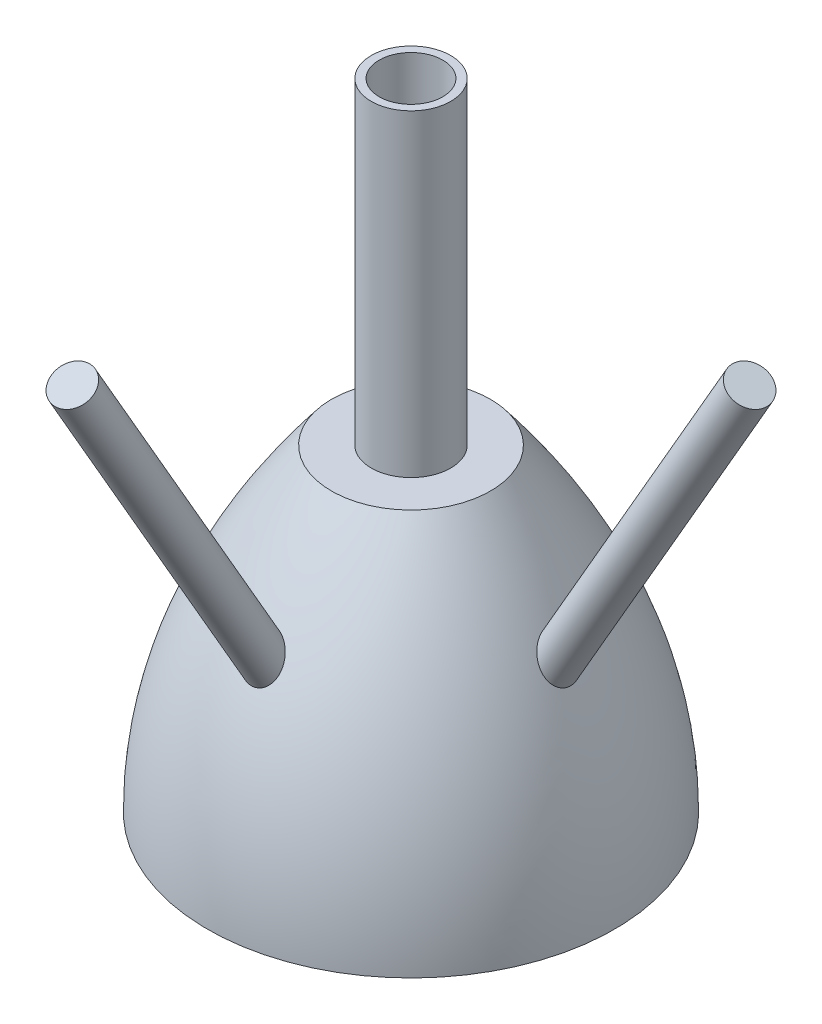
ISO-10303-21;
HEADER;
FILE_DESCRIPTION(('STEP AP214'),'2;1');
FILE_NAME('part.step','',(''),(''),'','','');
FILE_SCHEMA(('AUTOMOTIVE_DESIGN { 1 0 10303 214 1 1 1 1 }'));
ENDSEC;
DATA;
#1=APPLICATION_CONTEXT('core data for automotive mechanical design processes');
#2=APPLICATION_PROTOCOL_DEFINITION('international standard','automotive_design',2000,#1);
#3=PRODUCT_CONTEXT('',#1,'mechanical');
#4=PRODUCT('Part','Part','',(#3));
#5=PRODUCT_RELATED_PRODUCT_CATEGORY('part','',(#4));
#6=PRODUCT_DEFINITION_FORMATION('','',#4);
#7=PRODUCT_DEFINITION_CONTEXT('part definition',#1,'design');
#8=PRODUCT_DEFINITION('design','',#6,#7);
#9=PRODUCT_DEFINITION_SHAPE('','',#8);
#10=(LENGTH_UNIT() NAMED_UNIT(*) SI_UNIT(.MILLI.,.METRE.));
#11=(NAMED_UNIT(*) PLANE_ANGLE_UNIT() SI_UNIT($,.RADIAN.));
#12=(NAMED_UNIT(*) SI_UNIT($,.STERADIAN.) SOLID_ANGLE_UNIT());
#13=UNCERTAINTY_MEASURE_WITH_UNIT(LENGTH_MEASURE(1.E-05),#10,'distance_accuracy_value','');
#14=(GEOMETRIC_REPRESENTATION_CONTEXT(3) GLOBAL_UNCERTAINTY_ASSIGNED_CONTEXT((#13)) GLOBAL_UNIT_ASSIGNED_CONTEXT((#10,
#11,#12)) REPRESENTATION_CONTEXT('',''));
#15=CARTESIAN_POINT('',(0.,0.,0.));
#16=DIRECTION('',(0.,0.,1.));
#17=DIRECTION('',(1.,0.,0.));
#18=AXIS2_PLACEMENT_3D('',#15,#16,#17);
#19=CARTESIAN_POINT('',(253.999999999969,1014.69207151779,0.));
#20=DIRECTION('',(0.,-1.,0.));
#21=DIRECTION('',(1.,0.,0.));
#22=AXIS2_PLACEMENT_3D('',#19,#20,#21);
#23=PLANE('',#22);
#24=CARTESIAN_POINT('',(-3.06421554796649E-11,1014.69207151778,0.));
#25=DIRECTION('',(0.,1.,0.));
#26=DIRECTION('',(-1.,0.,0.));
#27=AXIS2_PLACEMENT_3D('',#24,#25,#26);
#28=CIRCLE('',#27,126.999999999444);
#29=CARTESIAN_POINT('',(-126.999999999475,1014.69207151777,0.));
#30=VERTEX_POINT('',#29);
#31=EDGE_CURVE('E59',#30,#30,#28,.T.);
#32=ORIENTED_EDGE('',*,*,#31,.F.);
#33=EDGE_LOOP('',(#32));
#34=FACE_BOUND('',#33,.T.);
#35=CARTESIAN_POINT('',(-3.06421554796755E-11,1014.69207151813,0.));
#36=DIRECTION('',(0.,1.,0.));
#37=DIRECTION('',(-1.,0.,0.));
#38=AXIS2_PLACEMENT_3D('',#35,#36,#37);
#39=CIRCLE('',#38,253.999999999444);
#40=CARTESIAN_POINT('',(-253.999999999475,1014.69207151812,0.));
#41=VERTEX_POINT('',#40);
#42=EDGE_CURVE('E63',#41,#41,#39,.T.);
#43=ORIENTED_EDGE('',*,*,#42,.T.);
#44=EDGE_LOOP('',(#43));
#45=FACE_BOUND('',#44,.T.);
#46=ADVANCED_FACE('F48',(#34,#45),#23,.F.);
#47=CARTESIAN_POINT('',(-999350.,-50990.1951359248,0.));
#48=CARTESIAN_POINT('',(1000650.,-3.02691205433803E-09,0.));
#49=CARTESIAN_POINT('',(-999349.999999999,50990.1951359309,0.));
#50=B_SPLINE_CURVE_WITH_KNOTS('',2,(#47,#48,#49),.UNSPECIFIED.,.F.,.F.,(3,3),(0.,1.),.UNSPECIFIED.);
#51=CARTESIAN_POINT('',(-3.06421554796543E-11,1014.69207151743,0.));
#52=DIRECTION('',(0.,1.,0.));
#53=AXIS1_PLACEMENT('',#51,#52);
#54=SURFACE_OF_REVOLUTION('',#50,#53);
#55=CARTESIAN_POINT('',(440.634399216976,737.801167006452,-7.75329829454941E-05));
#56=CARTESIAN_POINT('',(440.634400580243,737.801163879456,1.02726602211633));
#57=CARTESIAN_POINT('',(440.646867099696,737.772861056492,2.05470877192513));
#58=CARTESIAN_POINT('',(440.696670486729,737.659827745046,4.10654697177626));
#59=CARTESIAN_POINT('',(440.734024807575,737.575057657322,5.13093977620922));
#60=CARTESIAN_POINT('',(440.833381161142,737.349706543828,7.1725359579091));
#61=CARTESIAN_POINT('',(440.895387172602,737.20911650882,8.18973814763722));
#62=CARTESIAN_POINT('',(441.043824004993,736.872812138134,10.2156697613446));
#63=CARTESIAN_POINT('',(441.130312502447,736.676967636092,11.22437331528));
#64=CARTESIAN_POINT('',(441.32709461239,736.231805798519,13.227361579559));
#65=CARTESIAN_POINT('',(441.437384397011,735.982497061471,14.221648581051));
#66=CARTESIAN_POINT('',(441.681114088638,735.432191450847,16.192865159312));
#67=CARTESIAN_POINT('',(441.814552495549,735.131197926601,17.1697958562978));
#68=CARTESIAN_POINT('',(442.067077648672,734.562355556504,18.8579223453866));
#69=CARTESIAN_POINT('',(442.181202452466,734.305503166955,19.5735942525196));
#70=CARTESIAN_POINT('',(442.421572338323,733.765111110867,20.9927403541006));
#71=CARTESIAN_POINT('',(442.547818197014,733.481569734318,21.6962137635449));
#72=CARTESIAN_POINT('',(442.944197067607,732.592380977857,23.7867863330907));
#73=CARTESIAN_POINT('',(443.232017039797,731.948065963718,25.1543419988988));
#74=CARTESIAN_POINT('',(443.851554598957,730.565092357755,27.829459590913));
#75=CARTESIAN_POINT('',(444.183255112935,729.826470462621,29.1370445853226));
#76=CARTESIAN_POINT('',(444.887609178807,728.262956129355,31.6879816401558));
#77=CARTESIAN_POINT('',(445.260264047507,727.438060917317,32.9313316333392));
#78=CARTESIAN_POINT('',(446.072982052893,725.645193339986,35.4409580578049));
#79=CARTESIAN_POINT('',(446.516007743509,724.671124999625,36.701915335697));
#80=CARTESIAN_POINT('',(447.442276344463,722.642606373456,39.1415904567372));
#81=CARTESIAN_POINT('',(447.925520822259,721.58815295491,40.3203050913233));
#82=CARTESIAN_POINT('',(448.929000929151,719.407675475618,42.5935352148697));
#83=CARTESIAN_POINT('',(449.449250731248,718.281624010599,43.6880181053825));
#84=CARTESIAN_POINT('',(450.52339446771,715.966852258037,45.7907245844732));
#85=CARTESIAN_POINT('',(451.077290369892,714.778128305581,46.7989431194877));
#86=CARTESIAN_POINT('',(452.321456528028,712.120086169699,48.9071672642606));
#87=CARTESIAN_POINT('',(453.017959503541,710.639633710484,49.9894858045966));
#88=CARTESIAN_POINT('',(454.449564503748,707.613588285987,52.0304208548722));
#89=CARTESIAN_POINT('',(455.184670381084,706.067988821962,52.9890249847482));
#90=CARTESIAN_POINT('',(456.68964744453,702.921656281434,54.7823678040904));
#91=CARTESIAN_POINT('',(457.459536260778,701.320895345474,55.6170427387244));
#92=CARTESIAN_POINT('',(459.029800479208,698.074792798409,57.1615624586471));
#93=CARTESIAN_POINT('',(459.830177280532,696.429449142336,57.8714015066044));
#94=CARTESIAN_POINT('',(461.596555285648,692.819385571529,59.2763193518938));
#95=CARTESIAN_POINT('',(462.567524872407,690.848050267863,59.9482381344631));
#96=CARTESIAN_POINT('',(464.540406944863,686.86991715563,61.1198297669904));
#97=CARTESIAN_POINT('',(465.542322520443,684.863115814478,61.6194853559071));
#98=CARTESIAN_POINT('',(467.571811026844,680.825767563964,62.4457068145833));
#99=CARTESIAN_POINT('',(468.599395692571,678.795210028361,62.7721919430475));
#100=CARTESIAN_POINT('',(470.673931934363,674.723429015094,63.2504039991443));
#101=CARTESIAN_POINT('',(471.720884010433,672.68220526304,63.4021264085461));
#102=CARTESIAN_POINT('',(473.923715745573,668.415854479342,63.5349406517568));
#103=CARTESIAN_POINT('',(475.080862913799,666.190838334604,63.4993094173319));
#104=CARTESIAN_POINT('',(477.402609877655,661.757990491417,63.2157442509591));
#105=CARTESIAN_POINT('',(478.567210263032,659.550160184237,62.9677933074864));
#106=CARTESIAN_POINT('',(480.895028711311,655.167307386066,62.256886391473));
#107=CARTESIAN_POINT('',(482.058245963257,652.992299428466,61.7938379024395));
#108=CARTESIAN_POINT('',(484.37264088988,648.693287690309,60.6501871329833));
#109=CARTESIAN_POINT('',(485.5238193776,646.569280452682,59.9695996433988));
#110=CARTESIAN_POINT('',(487.401902610531,643.125796465582,58.6670920348574));
#111=CARTESIAN_POINT('',(488.135775848716,641.785833346767,58.1085654190669));
#112=CARTESIAN_POINT('',(489.590217046022,639.140665330233,56.8990095072073));
#113=CARTESIAN_POINT('',(490.310784850593,637.835460836177,56.24797913742));
#114=CARTESIAN_POINT('',(491.7349417095,635.26557248842,54.853396441712));
#115=CARTESIAN_POINT('',(492.438528773697,634.000893378647,54.1098333332418));
#116=CARTESIAN_POINT('',(493.823638667603,631.52019458972,52.5318413171938));
#117=CARTESIAN_POINT('',(494.505193719047,630.304103173583,51.6975536918481));
#118=CARTESIAN_POINT('',(495.843111910847,627.925044650531,49.9381227382755));
#119=CARTESIAN_POINT('',(496.499477351156,626.762072691658,49.0129877325065));
#120=CARTESIAN_POINT('',(497.782403970647,624.49626384508,47.0736061442676));
#121=CARTESIAN_POINT('',(498.408975609863,623.393405832324,46.059391197463));
#122=CARTESIAN_POINT('',(499.688927059944,621.147276112427,43.8378160248092));
#123=CARTESIAN_POINT('',(500.338715063728,620.01100424954,42.6212841052664));
#124=CARTESIAN_POINT('',(501.590386277985,617.828828828071,40.0867357261671));
#125=CARTESIAN_POINT('',(502.19227826378,616.782908712573,38.7687379442569));
#126=CARTESIAN_POINT('',(503.054053047657,615.289437724623,36.7203717272209));
#127=CARTESIAN_POINT('',(503.334453769672,614.804205806991,36.0257264907533));
#128=CARTESIAN_POINT('',(503.880820120215,613.859956993344,34.613359166028));
#129=CARTESIAN_POINT('',(504.146787165759,613.400937523706,33.8956393541582));
#130=CARTESIAN_POINT('',(504.663509416706,612.510244440328,32.4379468144126));
#131=CARTESIAN_POINT('',(504.914262516467,612.078574611473,31.6979710273633));
#132=CARTESIAN_POINT('',(505.399692468326,611.243863424702,30.1969893334605));
#133=CARTESIAN_POINT('',(505.634370466198,610.840820026324,29.4359849308867));
#134=CARTESIAN_POINT('',(506.163900194846,609.932347170009,27.6316103775813));
#135=CARTESIAN_POINT('',(506.452054241094,609.438746587031,26.5802741690256));
#136=CARTESIAN_POINT('',(506.996279034288,608.507651923156,24.4449557906937));
#137=CARTESIAN_POINT('',(507.252349321269,608.070158646632,23.3609731531633));
#138=CARTESIAN_POINT('',(507.730723650724,607.253731165078,21.1638374583405));
#139=CARTESIAN_POINT('',(507.953027106792,606.874797977021,20.0506838948494));
#140=CARTESIAN_POINT('',(508.362258014862,606.177854452688,17.7994564072072));
#141=CARTESIAN_POINT('',(508.549196446453,605.859825207513,16.6613903403379));
#142=CARTESIAN_POINT('',(508.88644121295,605.286496782731,14.3642280936696));
#143=CARTESIAN_POINT('',(509.036747753133,605.0311972516,13.205132031757));
#144=CARTESIAN_POINT('',(509.299606467157,604.584962614252,10.8704441110305));
#145=CARTESIAN_POINT('',(509.412162803484,604.394020411731,9.69485408580789));
#146=CARTESIAN_POINT('',(509.568763099894,604.12845518734,7.71103948875309));
#147=CARTESIAN_POINT('',(509.623202427617,604.036167226401,6.90594014389094));
#148=CARTESIAN_POINT('',(509.714101293214,603.882098033609,5.29174515747963));
#149=CARTESIAN_POINT('',(509.750559896735,603.820318387091,4.48264931046207));
#150=CARTESIAN_POINT('',(509.805354067845,603.727476736325,2.86220767872619));
#151=CARTESIAN_POINT('',(509.823692226212,603.696410340837,2.05086223228446));
#152=CARTESIAN_POINT('',(509.842190798114,603.665072007463,0.427287812638912));
#153=CARTESIAN_POINT('',(509.842349428813,603.664803089836,-0.384941239407873));
#154=CARTESIAN_POINT('',(509.824486932243,603.695062966146,-2.00831938930389));
#155=CARTESIAN_POINT('',(509.806472628396,603.725580200754,-2.81946877807244));
#156=CARTESIAN_POINT('',(509.752336579716,603.817305520276,-4.43950818874144));
#157=CARTESIAN_POINT('',(509.716212963817,603.878516776516,-5.24839796849184));
#158=CARTESIAN_POINT('',(509.625991558441,604.031435567014,-6.86219134584131));
#159=CARTESIAN_POINT('',(509.571895733825,604.123139767548,-7.66709536943546));
#160=CARTESIAN_POINT('',(509.445914506262,604.336777973943,-9.27155854593463));
#161=CARTESIAN_POINT('',(509.374027430585,604.458714822275,-10.071117189004));
#162=CARTESIAN_POINT('',(509.215970636892,604.726928677449,-11.631223223086));
#163=CARTESIAN_POINT('',(509.130493464146,604.872026392808,-12.3920439542366));
#164=CARTESIAN_POINT('',(508.943654393672,605.189338639364,-13.9061091135832));
#165=CARTESIAN_POINT('',(508.842291089361,605.361555571748,-14.6593528646104));
#166=CARTESIAN_POINT('',(508.624013218424,605.732617096511,-16.1568759546052));
#167=CARTESIAN_POINT('',(508.50710074077,605.93145811207,-16.9011564831258));
#168=CARTESIAN_POINT('',(508.258075311661,606.355259384995,-18.3796917390016));
#169=CARTESIAN_POINT('',(508.125960979941,606.580222014109,-19.1139455491921));
#170=CARTESIAN_POINT('',(507.707405922826,607.293430775501,-21.2998562189701));
#171=CARTESIAN_POINT('',(507.398703989021,607.820081244776,-22.7349982329108));
#172=CARTESIAN_POINT('',(506.725623762508,608.970383261037,-25.5521180702138));
#173=CARTESIAN_POINT('',(506.361243448623,609.594038329397,-26.9340939613149));
#174=CARTESIAN_POINT('',(505.565324707829,610.959046900232,-29.691245486187));
#175=CARTESIAN_POINT('',(505.131704464548,611.704072144774,-31.0640035401947));
#176=CARTESIAN_POINT('',(504.213300056736,613.285780941705,-33.7376002646527));
#177=CARTESIAN_POINT('',(503.7285150041,614.12246608511,-35.038437686128));
#178=CARTESIAN_POINT('',(502.712569390789,615.880488415965,-37.5628661165445));
#179=CARTESIAN_POINT('',(502.181398419804,616.801844608428,-38.7864396785787));
#180=CARTESIAN_POINT('',(501.0777111375,618.721764678967,-41.1515494115457));
#181=CARTESIAN_POINT('',(500.505192972558,619.720332018609,-42.293081899943));
#182=CARTESIAN_POINT('',(499.26423164218,621.891463772442,-44.6011997887199));
#183=CARTESIAN_POINT('',(498.591932175083,623.071426901473,-45.7587563683164));
#184=CARTESIAN_POINT('',(497.209442679071,625.506732663777,-47.9669128229833));
#185=CARTESIAN_POINT('',(496.49925049937,626.762079576328,-49.0175066170004));
#186=CARTESIAN_POINT('',(495.046735268028,629.339539773053,-51.009813665415));
#187=CARTESIAN_POINT('',(494.304401480792,630.661675390238,-51.9514901487955));
#188=CARTESIAN_POINT('',(492.793465375864,633.363738073288,-53.7242420788844));
#189=CARTESIAN_POINT('',(492.024861885562,634.743667719544,-54.5553125803126));
#190=CARTESIAN_POINT('',(490.361473449488,637.742846475725,-56.2109090739464));
#191=CARTESIAN_POINT('',(489.463655490783,639.36926484065,-57.0194232345092));
#192=CARTESIAN_POINT('',(487.648054004817,642.674984862987,-58.4931437934585));
#193=CARTESIAN_POINT('',(486.730268934361,644.354290612421,-59.1583390715449));
#194=CARTESIAN_POINT('',(484.880919704037,647.755951020735,-60.3462097188763));
#195=CARTESIAN_POINT('',(483.949350747199,649.478320817491,-60.8688341803188));
#196=CARTESIAN_POINT('',(482.078683318449,652.955788374051,-61.7722808734551));
#197=CARTESIAN_POINT('',(481.139584528336,654.710887521154,-62.1530970799152));
#198=CARTESIAN_POINT('',(479.132928537984,658.482098711132,-62.8158966681552));
#199=CARTESIAN_POINT('',(478.065059607981,660.501605237166,-63.0777346579695));
#200=CARTESIAN_POINT('',(475.933831688419,664.558238730141,-63.422498890528));
#201=CARTESIAN_POINT('',(474.870473084126,666.59536715888,-63.5054101449641));
#202=CARTESIAN_POINT('',(472.754260039981,670.676269066446,-63.4942018386926));
#203=CARTESIAN_POINT('',(471.701412956709,672.720046030527,-63.3999659873481));
#204=CARTESIAN_POINT('',(469.613159417246,676.800847828661,-63.035950222509));
#205=CARTESIAN_POINT('',(468.577753324332,678.837872521366,-62.7661666571857));
#206=CARTESIAN_POINT('',(466.441560949123,683.068833150053,-62.0215308990954));
#207=CARTESIAN_POINT('',(465.342877581694,685.261081242055,-61.5309433698078));
#208=CARTESIAN_POINT('',(463.18035435214,689.607585891945,-60.3454651724065));
#209=CARTESIAN_POINT('',(462.116518678751,691.761837868395,-59.6505500432951));
#210=CARTESIAN_POINT('',(460.031509777523,696.014532235154,-58.0576376709347));
#211=CARTESIAN_POINT('',(459.010324992169,698.112989687883,-57.1596958723255));
#212=CARTESIAN_POINT('',(457.018142099303,702.235879796139,-55.1614522468984));
#213=CARTESIAN_POINT('',(456.047133066162,704.260328538531,-54.0611947136442));
#214=CARTESIAN_POINT('',(454.333710702307,707.857228662753,-51.8763596647541));
#215=CARTESIAN_POINT('',(453.581692590707,709.445260448303,-50.8248642997727));
#216=CARTESIAN_POINT('',(452.121674672125,712.545215276251,-48.5873944242989));
#217=CARTESIAN_POINT('',(451.413672472884,714.05714245407,-47.4014272322395));
#218=CARTESIAN_POINT('',(450.047778863146,716.989169700654,-44.8977925168174));
#219=CARTESIAN_POINT('',(449.389836689456,718.409362565359,-43.5802616278321));
#220=CARTESIAN_POINT('',(448.129190351746,721.143778569093,-40.8151212409758));
#221=CARTESIAN_POINT('',(447.526476609097,722.458020079188,-39.3675343861449));
#222=CARTESIAN_POINT('',(446.482366832677,724.744913242465,-36.6100165829156));
#223=CARTESIAN_POINT('',(446.031157875744,725.737191007453,-35.3200255412684));
#224=CARTESIAN_POINT('',(445.17456162759,727.627371347566,-32.6578426376382));
#225=CARTESIAN_POINT('',(444.769171278185,728.525280221106,-31.2856562711865));
#226=CARTESIAN_POINT('',(444.198621971391,729.792820599607,-29.1702755358144));
#227=CARTESIAN_POINT('',(444.014687082918,730.202131077359,-28.455596558795));
#228=CARTESIAN_POINT('',(443.659800473669,730.993009374759,-27.0079304130024));
#229=CARTESIAN_POINT('',(443.488847399699,731.37458008576,-26.2749451630472));
#230=CARTESIAN_POINT('',(443.1604282235,732.108606953624,-24.7916007498517));
#231=CARTESIAN_POINT('',(443.002961831702,732.46106373558,-24.0412419600741));
#232=CARTESIAN_POINT('',(442.702019814406,733.135494307148,-22.5242798453492));
#233=CARTESIAN_POINT('',(442.558542898922,733.457470907293,-21.7576780261405));
#234=CARTESIAN_POINT('',(442.26205405728,734.123564747196,-20.0730464074166));
#235=CARTESIAN_POINT('',(442.111809272961,734.46160304924,-19.1521143243273));
#236=CARTESIAN_POINT('',(441.83205974257,735.091726529995,-17.2915834650216));
#237=CARTESIAN_POINT('',(441.702554588198,735.383812613364,-16.3519850566988));
#238=CARTESIAN_POINT('',(441.464940138878,735.920235740007,-14.4564317562655));
#239=CARTESIAN_POINT('',(441.356833707787,736.164566391973,-13.5004746934027));
#240=CARTESIAN_POINT('',(441.162870510563,736.603273139434,-11.5773654865955));
#241=CARTESIAN_POINT('',(441.076960797015,736.797768102189,-10.6102458413615));
#242=CARTESIAN_POINT('',(440.927554543679,737.13620536801,-8.6656181539875));
#243=CARTESIAN_POINT('',(440.864055036542,737.280154363887,-7.68811150486722));
#244=CARTESIAN_POINT('',(440.759863759273,737.516433644645,-5.72625383816793));
#245=CARTESIAN_POINT('',(440.719157461228,737.608796809157,-4.74190758604735));
#246=CARTESIAN_POINT('',(440.671446755991,737.71707100269,-3.13076150414413));
#247=CARTESIAN_POINT('',(440.657558085429,737.748595949655,-2.50516709417535));
#248=CARTESIAN_POINT('',(440.639033521489,737.79064576462,-1.25308664363086));
#249=CARTESIAN_POINT('',(440.634398385591,737.801168913444,-0.626600534262218));
#250=CARTESIAN_POINT('',(440.634399216976,737.801167006452,-7.75329829454941E-05));
#251=B_SPLINE_CURVE_WITH_KNOTS('',3,(#55,#56,#57,#58,#59,#60,#61,#62,#63,#64,#65,#66,#67,#68,
#69,#70,#71,#72,#73,#74,#75,#76,#77,#78,#79,#80,#81,#82,#83,#84,#85,#86,#87,#88,#89,#90,#91,#92,
#93,#94,#95,#96,#97,#98,#99,#100,#101,#102,#103,#104,#105,#106,#107,#108,#109,#110,#111,#112,
#113,#114,#115,#116,#117,#118,#119,#120,#121,#122,#123,#124,#125,#126,#127,#128,#129,#130,#131,
#132,#133,#134,#135,#136,#137,#138,#139,#140,#141,#142,#143,#144,#145,#146,#147,#148,#149,#150,
#151,#152,#153,#154,#155,#156,#157,#158,#159,#160,#161,#162,#163,#164,#165,#166,#167,#168,#169,
#170,#171,#172,#173,#174,#175,#176,#177,#178,#179,#180,#181,#182,#183,#184,#185,#186,#187,#188,
#189,#190,#191,#192,#193,#194,#195,#196,#197,#198,#199,#200,#201,#202,#203,#204,#205,#206,#207,
#208,#209,#210,#211,#212,#213,#214,#215,#216,#217,#218,#219,#220,#221,#222,#223,#224,#225,#226,
#227,#228,#229,#230,#231,#232,#233,#234,#235,#236,#237,#238,#239,#240,#241,#242,#243,#244,#245,
#246,#247,#248,#249,#250),.UNSPECIFIED.,.T.,.F.,(4,2,2,2,2,2,2,2,2,2,2,2,2,2,2,2,2,2,2,2,2,2,2,
2,2,2,2,2,2,2,2,2,2,2,2,2,2,2,2,2,2,2,2,2,2,2,2,2,2,2,2,2,2,2,2,2,2,2,2,2,2,2,2,2,2,2,2,2,2,2,2,
2,2,2,2,2,2,2,2,2,2,2,2,2,2,2,2,2,2,2,2,2,2,2,2,2,2,4),(0.,3.08173900239366,6.16564143843547,
9.25004181310845,12.3417698569626,15.4330010404665,18.5240319784336,20.8300363980294,
23.1361886681144,27.7475230488669,32.3570685049778,36.9667622153017,41.9234426240405,
46.8803163015452,51.8390987867031,56.7981715700785,62.6775127769298,68.5574418722304,
74.4403854678145,80.3235993669389,87.2100889176009,94.0972683048727,100.987656045631,
107.87822192314,115.393718037139,122.909816365667,130.429150471828,137.947973434679,
142.825238573741,147.702560329277,152.580450956912,157.45085133977,162.320805964527,
167.18903802325,172.544434525934,177.898847563625,180.57577239969,183.252433953239,
185.929465121458,188.606305281787,192.194023965765,195.781794078635,199.36962649081,
202.956343173353,206.543039756296,210.129340725917,212.565221314523,215.001228468039,
217.436887282044,219.872784957022,222.307768361635,224.74300340213,227.1779722914,
229.613170203189,231.950204931988,234.287446702671,236.624374790316,238.961515228733,
243.63475041308,248.308155280616,253.165866940749,258.023662933516,262.882551968415,
267.741658965735,273.089507200791,278.437659302388,283.787611728408,289.137803274695,
295.209855005269,301.282377704763,307.35706589194,313.432012154646,320.322931105172,
327.214427270769,334.11044903307,341.006614254348,348.499972202339,355.994227580204,
363.486438815324,370.977011707928,377.114246332833,383.251147107866,389.381739463407,
395.511266529592,400.573170140104,405.634735691646,408.165758226339,410.696516569835,
413.227220562411,415.757690974789,418.733583641784,421.709417715148,424.685649784372,
427.654715487556,430.623387907202,433.590165997177,435.469403305739,437.348794439655),.UNSPECIFIED.);
#252=CARTESIAN_POINT('',(440.634399216976,737.801167006452,-7.75329829454941E-05));
#253=VERTEX_POINT('',#252);
#254=EDGE_CURVE('E147',#253,#253,#251,.T.);
#255=ORIENTED_EDGE('',*,*,#254,.F.);
#256=EDGE_LOOP('',(#255));
#257=FACE_BOUND('',#256,.T.);
#258=CARTESIAN_POINT('',(7.0173786005993E-05,603.66878356444,509.83999990388));
#259=CARTESIAN_POINT('',(1.61277116923029,603.66878410515,509.839999298818));
#260=CARTESIAN_POINT('',(3.22548205519215,603.729600355317,509.804092748388));
#261=CARTESIAN_POINT('',(6.43857935620816,603.972127041504,509.660975468935));
#262=CARTESIAN_POINT('',(8.03896575066934,604.153837679481,509.553764620798));
#263=CARTESIAN_POINT('',(11.2156391923782,604.636000069329,509.269523474999));
#264=CARTESIAN_POINT('',(12.7919231175715,604.936467070921,509.092484210548));
#265=CARTESIAN_POINT('',(15.9088482087724,605.652630487829,508.671001590551));
#266=CARTESIAN_POINT('',(17.4494892593573,606.068327276236,508.426558016762));
#267=CARTESIAN_POINT('',(20.4807816543278,607.00906413482,507.874189341964));
#268=CARTESIAN_POINT('',(21.9715512936124,607.533820454719,507.566428998596));
#269=CARTESIAN_POINT('',(24.8979711907313,608.687754440804,506.890863956483));
#270=CARTESIAN_POINT('',(26.3336217113736,609.316931609033,506.523059544074));
#271=CARTESIAN_POINT('',(29.14177722908,610.673446566008,505.731694653817));
#272=CARTESIAN_POINT('',(30.5142776038968,611.400791524823,505.308130103364));
#273=CARTESIAN_POINT('',(33.1893468060934,612.946983746482,504.409804013151));
#274=CARTESIAN_POINT('',(34.4919134513797,613.765833862044,503.935040877267));
#275=CARTESIAN_POINT('',(36.4181858052273,615.077265228076,503.176636706838));
#276=CARTESIAN_POINT('',(37.0695715473105,615.539354281359,502.909743639033));
#277=CARTESIAN_POINT('',(38.350937400484,616.485616329649,502.363957088695));
#278=CARTESIAN_POINT('',(38.9809182648587,616.969788546093,502.085064029253));
#279=CARTESIAN_POINT('',(40.2188092162476,617.959160951476,501.515989367015));
#280=CARTESIAN_POINT('',(40.8267204936142,618.46436000314,501.225808374804));
#281=CARTESIAN_POINT('',(42.0200546639477,619.494849694075,500.634798200833));
#282=CARTESIAN_POINT('',(42.6054738623082,620.020143606138,500.333967285151));
#283=CARTESIAN_POINT('',(44.3272358954046,621.624640372213,499.416528900835));
#284=CARTESIAN_POINT('',(45.4291691918749,622.732527177674,498.78493612408));
#285=CARTESIAN_POINT('',(47.5379353268434,625.016559741152,497.487280859477));
#286=CARTESIAN_POINT('',(48.5447582112067,626.19271262306,496.821214774965));
#287=CARTESIAN_POINT('',(50.040393516863,628.075662028583,495.758735343867));
#288=CARTESIAN_POINT('',(50.5625777480058,628.761838372677,495.372308394429));
#289=CARTESIAN_POINT('',(51.5760578487627,630.151815647564,494.591146942639));
#290=CARTESIAN_POINT('',(52.067360192179,630.855612840933,494.196414204751));
#291=CARTESIAN_POINT('',(53.0190501014905,632.279773957538,493.399354902848));
#292=CARTESIAN_POINT('',(53.4794335448594,633.000140072844,492.997027335313));
#293=CARTESIAN_POINT('',(54.3691008017567,634.456120519904,492.185628784947));
#294=CARTESIAN_POINT('',(54.7983828543528,635.191735712017,491.776557421897));
#295=CARTESIAN_POINT('',(56.0397066042608,637.420154362437,490.540118086171));
#296=CARTESIAN_POINT('',(56.805044893622,638.934259253899,489.703676978779));
#297=CARTESIAN_POINT('',(58.2106886049262,642.009422483011,488.012832302333));
#298=CARTESIAN_POINT('',(58.8509884958487,643.570482894196,487.158427940534));
#299=CARTESIAN_POINT('',(60.0878442143625,646.952023479258,485.316634203352));
#300=CARTESIAN_POINT('',(60.6658064368193,648.778289583322,484.327335001646));
#301=CARTESIAN_POINT('',(61.6611502106197,652.469106354508,482.339469286167));
#302=CARTESIAN_POINT('',(62.0785187199861,654.333660118063,481.340902026467));
#303=CARTESIAN_POINT('',(62.7542730145391,658.090577091877,479.340739993342));
#304=CARTESIAN_POINT('',(63.0126019426973,659.982950000287,478.339144265678));
#305=CARTESIAN_POINT('',(63.3716653765158,663.784302293731,476.339298650543));
#306=CARTESIAN_POINT('',(63.4723936623188,665.693282331192,475.341048896675));
#307=CARTESIAN_POINT('',(63.5205147106531,669.744174225868,473.235748383116));
#308=CARTESIAN_POINT('',(63.4483490496396,671.88691465047,472.129803441217));
#309=CARTESIAN_POINT('',(63.1108653023732,676.166674500894,469.936228539098));
#310=CARTESIAN_POINT('',(62.8455312437634,678.303693438962,468.84860010101));
#311=CARTESIAN_POINT('',(62.1230566730288,682.559831902201,466.69762221775));
#312=CARTESIAN_POINT('',(61.6657525566355,684.678934583266,465.634294299391));
#313=CARTESIAN_POINT('',(60.5606094482016,688.882986796892,463.539563690413));
#314=CARTESIAN_POINT('',(59.9127714782994,690.967936512608,462.508160828561));
#315=CARTESIAN_POINT('',(58.3946908845665,695.17946510275,460.439261834145));
#316=CARTESIAN_POINT('',(57.5159045062726,697.303828751099,459.403500628072));
#317=CARTESIAN_POINT('',(55.5522073757038,701.480380658623,457.381702117649));
#318=CARTESIAN_POINT('',(54.4672689537202,703.532559185248,456.395671510643));
#319=CARTESIAN_POINT('',(52.0937151575345,707.540934159101,454.483076353169));
#320=CARTESIAN_POINT('',(50.8053619847491,709.497249976886,453.55643737962));
#321=CARTESIAN_POINT('',(48.0256798368836,713.292641162747,451.770601307106));
#322=CARTESIAN_POINT('',(46.5344285108222,715.131760988221,450.911378605344));
#323=CARTESIAN_POINT('',(43.7892369022603,718.180633781869,449.495799147244));
#324=CARTESIAN_POINT('',(42.5825223999174,719.424568831617,448.921048770308));
#325=CARTESIAN_POINT('',(40.066163571528,721.825175107064,447.81661068012));
#326=CARTESIAN_POINT('',(38.7565363278784,722.981860753007,447.28691551846));
#327=CARTESIAN_POINT('',(36.0377104123921,725.195425437885,446.277237961586));
#328=CARTESIAN_POINT('',(34.6285419664356,726.252334548336,445.797240583776));
#329=CARTESIAN_POINT('',(32.4441101447696,727.752811855598,445.118223323283));
#330=CARTESIAN_POINT('',(31.7040639107627,728.238893276551,444.898682609918));
#331=CARTESIAN_POINT('',(30.2011741338324,729.181081121921,444.473874137098));
#332=CARTESIAN_POINT('',(29.4383323153969,729.637189805468,444.268605301863));
#333=CARTESIAN_POINT('',(27.6234416902894,730.669806061323,443.804632839471));
#334=CARTESIAN_POINT('',(26.5625048196917,731.233488295057,443.551960201823));
#335=CARTESIAN_POINT('',(24.4038501248316,732.299220473856,443.075159052396));
#336=CARTESIAN_POINT('',(23.3061314885774,732.801269057158,442.851031171295));
#337=CARTESIAN_POINT('',(21.0772558108166,733.739625136873,442.432826349228));
#338=CARTESIAN_POINT('',(19.9460973623374,734.175929862405,442.238750674852));
#339=CARTESIAN_POINT('',(17.6555313764741,734.978467973624,441.882273397138));
#340=CARTESIAN_POINT('',(16.4961524597228,735.344769269704,441.719841093544));
#341=CARTESIAN_POINT('',(14.1527380038142,736.004299776716,441.427711811861));
#342=CARTESIAN_POINT('',(12.9687029572547,736.297530445989,441.298014180452));
#343=CARTESIAN_POINT('',(10.5813618850058,736.80787538604,441.072476018589));
#344=CARTESIAN_POINT('',(9.37806008011174,737.025006095886,440.976628175888));
#345=CARTESIAN_POINT('',(7.1377400877718,737.354438660758,440.831286230953));
#346=CARTESIAN_POINT('',(6.10260268029551,737.477527464219,440.777018674359));
#347=CARTESIAN_POINT('',(4.0261392786222,737.665942405816,440.69397134927));
#348=CARTESIAN_POINT('',(2.98481391890367,737.731274366545,440.665189011554));
#349=CARTESIAN_POINT('',(0.899798193188201,737.803652414961,440.633303496284));
#350=CARTESIAN_POINT('',(-0.143892063503,737.810701143672,440.630199155166));
#351=CARTESIAN_POINT('',(-2.22945983791038,737.76647011494,440.649684210328));
#352=CARTESIAN_POINT('',(-3.27133783296063,737.715209233079,440.672265291901));
#353=CARTESIAN_POINT('',(-5.349780799609,737.554809396922,440.742953409917));
#354=CARTESIAN_POINT('',(-6.38634556805789,737.445668246019,440.791061415131));
#355=CARTESIAN_POINT('',(-8.45034194676626,737.170386506547,440.912480412386));
#356=CARTESIAN_POINT('',(-9.47777418947396,737.004249897096,440.985789645013));
#357=CARTESIAN_POINT('',(-11.207015167321,736.675748016438,441.130869386205));
#358=CARTESIAN_POINT('',(-11.9121464028536,736.527821761433,441.196230129521));
#359=CARTESIAN_POINT('',(-13.3152129826222,736.205736657171,441.338638858311));
#360=CARTESIAN_POINT('',(-14.0131479543476,736.031576457141,441.415687445588));
#361=CARTESIAN_POINT('',(-16.094328054564,735.470686330515,441.664016529553));
#362=CARTESIAN_POINT('',(-17.4653801940202,735.045464393213,441.852516723328));
#363=CARTESIAN_POINT('',(-20.1665381994586,734.098218955405,442.273278391908));
#364=CARTESIAN_POINT('',(-21.4966412456084,733.57618880581,442.505542872598));
#365=CARTESIAN_POINT('',(-24.1095964709319,732.44173075558,443.011485196238));
#366=CARTESIAN_POINT('',(-25.3924459144954,731.829297631572,443.285165432163));
#367=CARTESIAN_POINT('',(-27.993210728521,730.475212075336,443.89188728418));
#368=CARTESIAN_POINT('',(-29.3073250500931,729.727524372325,444.227738731508));
#369=CARTESIAN_POINT('',(-31.8701582038845,728.145074504245,444.940818540247));
#370=CARTESIAN_POINT('',(-33.1188748279,727.310309401783,445.318048297501));
#371=CARTESIAN_POINT('',(-35.5474505508972,725.561813956668,446.110926376265));
#372=CARTESIAN_POINT('',(-36.7272863203464,724.648057116958,446.526587592534));
#373=CARTESIAN_POINT('',(-39.0148484099293,722.749876141374,447.393249978971));
#374=CARTESIAN_POINT('',(-40.1225708322687,721.765448191697,447.844253056502));
#375=CARTESIAN_POINT('',(-42.4365121744668,719.569721402196,448.854125196421));
#376=CARTESIAN_POINT('',(-43.6298359016867,718.347427630866,449.41866445802));
#377=CARTESIAN_POINT('',(-45.9144684696556,715.828823415244,450.58749753486));
#378=CARTESIAN_POINT('',(-47.0057682775454,714.532506433521,451.191794862093));
#379=CARTESIAN_POINT('',(-49.0855117126596,711.875352324747,452.436620640585));
#380=CARTESIAN_POINT('',(-50.0739082639344,710.514486078624,453.077165469239));
#381=CARTESIAN_POINT('',(-51.9465299858435,707.737947730304,454.390731425632));
#382=CARTESIAN_POINT('',(-52.8307501531368,706.322273000122,455.063754111017));
#383=CARTESIAN_POINT('',(-54.6489033703949,703.177486186529,456.566615497824));
#384=CARTESIAN_POINT('',(-55.5616489507963,701.438932242206,457.402390371831));
#385=CARTESIAN_POINT('',(-57.2396130753018,697.909116010679,459.109992263926));
#386=CARTESIAN_POINT('',(-58.0048163304814,696.117848283207,459.981823006911));
#387=CARTESIAN_POINT('',(-59.3875123250487,692.493332961486,461.757146946927));
#388=CARTESIAN_POINT('',(-60.0049348115087,690.660065853264,462.660654969837));
#389=CARTESIAN_POINT('',(-61.0910249198207,686.963076585922,464.49430612086));
#390=CARTESIAN_POINT('',(-61.5596865536894,685.099353204036,465.4244503195));
#391=CARTESIAN_POINT('',(-62.4019341600491,681.092342492713,467.436982226802));
#392=CARTESIAN_POINT('',(-62.7534231841333,678.946021850679,468.522641948076));
#393=CARTESIAN_POINT('',(-63.2610946188573,674.641257901842,470.715715149232));
#394=CARTESIAN_POINT('',(-63.4172587198205,672.482813477608,471.823130658609));
#395=CARTESIAN_POINT('',(-63.5323544702294,668.166729633968,474.053162016041));
#396=CARTESIAN_POINT('',(-63.4911624548602,666.009091566758,475.175786955061));
#397=CARTESIAN_POINT('',(-63.2090309651683,661.710413411884,477.427811102964));
#398=CARTESIAN_POINT('',(-62.9680943201429,659.569373089554,478.55721021567));
#399=CARTESIAN_POINT('',(-62.272768834526,655.247979047747,480.851979430448));
#400=CARTESIAN_POINT('',(-61.8115342830272,653.068692948464,482.017294007185));
#401=CARTESIAN_POINT('',(-60.6706477371197,648.760655084012,484.33620426334));
#402=CARTESIAN_POINT('',(-59.9909744058142,646.631908277296,485.489798786593));
#403=CARTESIAN_POINT('',(-58.8070759951295,643.492943968107,487.201593947894));
#404=CARTESIAN_POINT('',(-58.3852261797638,642.456011362912,487.768892407362));
#405=CARTESIAN_POINT('',(-57.4865291464949,640.402161124868,488.896005293854));
#406=CARTESIAN_POINT('',(-57.0096887212721,639.385241038114,489.455820635714));
#407=CARTESIAN_POINT('',(-56.0010362838162,637.374146368434,490.566247652163));
#408=CARTESIAN_POINT('',(-55.4692337852807,636.379967885301,491.116860900491));
#409=CARTESIAN_POINT('',(-54.3507353690596,634.416982789981,492.207186756937));
#410=CARTESIAN_POINT('',(-53.764043068104,633.44817451151,492.746900080413));
#411=CARTESIAN_POINT('',(-52.2021147885728,631.019659384864,494.103587596902));
#412=CARTESIAN_POINT('',(-51.1889735676106,629.579246141029,494.911870782459));
#413=CARTESIAN_POINT('',(-49.0338751689146,626.776399485815,496.491008510846));
#414=CARTESIAN_POINT('',(-47.8919370233911,625.413954597853,497.261868559643));
#415=CARTESIAN_POINT('',(-46.0849975018718,623.437739416598,498.38415533851));
#416=CARTESIAN_POINT('',(-45.4669923605611,622.790224665688,498.752594240899));
#417=CARTESIAN_POINT('',(-44.2000647217168,621.519059874596,499.477201138198));
#418=CARTESIAN_POINT('',(-43.5511452353231,620.895407520779,499.833370322412));
#419=CARTESIAN_POINT('',(-42.2228904192748,619.673388035026,500.532474618911));
#420=CARTESIAN_POINT('',(-41.54355116877,619.075024181995,500.875408014547));
#421=CARTESIAN_POINT('',(-40.1553305074365,617.905254312204,501.546926989284));
#422=CARTESIAN_POINT('',(-39.446451239206,617.333846346664,501.875513605458));
#423=CARTESIAN_POINT('',(-37.7523561311313,616.028757143688,502.627169911128));
#424=CARTESIAN_POINT('',(-36.7555866439877,615.306456559114,503.0440949576));
#425=CARTESIAN_POINT('',(-34.7126929785406,613.916884196013,503.847710204426));
#426=CARTESIAN_POINT('',(-33.6665676779642,613.249613669731,504.234399716739));
#427=CARTESIAN_POINT('',(-31.5278199107872,611.973765849398,504.975044914466));
#428=CARTESIAN_POINT('',(-30.4351949025606,611.365191769587,505.32899880722));
#429=CARTESIAN_POINT('',(-28.2078150554976,610.210845209732,506.00141914483));
#430=CARTESIAN_POINT('',(-27.0730932813821,609.665024765848,506.319912686766));
#431=CARTESIAN_POINT('',(-24.7646977022795,608.639090712947,506.919370049041));
#432=CARTESIAN_POINT('',(-23.5910253418971,608.158974670452,507.200335259299));
#433=CARTESIAN_POINT('',(-21.209481126682,607.267724722166,507.722500754433));
#434=CARTESIAN_POINT('',(-20.0016168323278,606.856575703591,507.963709750909));
#435=CARTESIAN_POINT('',(-17.2748338071687,606.019597750859,508.455206614431));
#436=CARTESIAN_POINT('',(-15.7482832809102,605.612152705868,508.694816541621));
#437=CARTESIAN_POINT('',(-12.6608749711012,604.910372893537,509.107858762261));
#438=CARTESIAN_POINT('',(-11.10002206185,604.616022164192,509.281300394606));
#439=CARTESIAN_POINT('',(-7.955287114934,604.143773271216,509.559704182616));
#440=CARTESIAN_POINT('',(-6.37141353694695,603.9658333821,509.664690874745));
#441=CARTESIAN_POINT('',(-3.19167345830183,603.728335915399,509.80484041833));
#442=CARTESIAN_POINT('',(-1.59580648487311,603.668783029371,509.840000502629));
#443=CARTESIAN_POINT('',(7.0173786005993E-05,603.66878356444,509.83999990388));
#444=B_SPLINE_CURVE_WITH_KNOTS('',3,(#258,#259,#260,#261,#262,#263,#264,#265,#266,#267,#268,
#269,#270,#271,#272,#273,#274,#275,#276,#277,#278,#279,#280,#281,#282,#283,#284,#285,#286,#287,
#288,#289,#290,#291,#292,#293,#294,#295,#296,#297,#298,#299,#300,#301,#302,#303,#304,#305,#306,
#307,#308,#309,#310,#311,#312,#313,#314,#315,#316,#317,#318,#319,#320,#321,#322,#323,#324,#325,
#326,#327,#328,#329,#330,#331,#332,#333,#334,#335,#336,#337,#338,#339,#340,#341,#342,#343,#344,
#345,#346,#347,#348,#349,#350,#351,#352,#353,#354,#355,#356,#357,#358,#359,#360,#361,#362,#363,
#364,#365,#366,#367,#368,#369,#370,#371,#372,#373,#374,#375,#376,#377,#378,#379,#380,#381,#382,
#383,#384,#385,#386,#387,#388,#389,#390,#391,#392,#393,#394,#395,#396,#397,#398,#399,#400,#401,
#402,#403,#404,#405,#406,#407,#408,#409,#410,#411,#412,#413,#414,#415,#416,#417,#418,#419,#420,
#421,#422,#423,#424,#425,#426,#427,#428,#429,#430,#431,#432,#433,#434,#435,#436,#437,#438,#439,
#440,#441,#442,#443),.UNSPECIFIED.,.T.,.F.,(4,2,2,2,2,2,2,2,2,2,2,2,2,2,2,2,2,2,2,2,2,2,2,2,2,2,
2,2,2,2,2,2,2,2,2,2,2,2,2,2,2,2,2,2,2,2,2,2,2,2,2,2,2,2,2,2,2,2,2,2,2,2,2,2,2,2,2,2,2,2,2,2,2,2,
2,2,2,2,2,2,2,2,2,2,2,2,2,2,2,2,2,2,4),(0.,4.83658264031379,9.67317336031186,14.5103853577082,
19.3476130172986,24.1724093313077,28.9971826378163,33.8223085315143,38.6475848928546,
41.1732181135665,43.6987623594743,46.2241701838197,48.7499910798426,53.8012823253249,
58.8531016481781,61.6871878817265,64.5206780077067,67.3545451859545,70.1885726899893,
75.8577054165061,81.5270888579245,87.9881390301167,94.4497138000114,100.91359725887,
107.377735814528,114.606915793023,121.836693592702,129.072645436335,136.308558462673,
143.863383982149,151.419224226814,158.965403340326,166.508702615656,171.981346760061,
177.453084416071,182.923167651935,185.659073389313,188.394772676567,192.075337805955,
195.755984240847,199.43678575914,203.11399819821,206.791137241656,210.467481461435,
213.597151042903,216.726505079657,219.855717313318,222.98391686837,226.112235149896,
229.240335073429,231.410065275822,233.57990723484,237.918271694591,242.256934237169,
246.595847560528,251.237573549955,255.879456169938,260.522901954264,265.166598513188,
270.55864657381,275.95117157726,281.346152799841,286.741393024847,293.137120179952,
299.533509730062,305.932934022374,312.332615874302,319.616916408577,326.901899718971,
334.191448451051,341.48089393156,349.013259814775,356.54636167621,360.310208928595,
364.073591751108,367.836324235882,371.598808965778,377.405658705475,383.211651493429,
386.114821787063,389.01770988,391.920973213744,394.824026333114,398.720481565189,
402.617025439214,406.513782568542,410.407541246442,414.301155673117,418.193915772013,
422.982244666849,427.769897493889,432.555833326673,437.341958817484),.UNSPECIFIED.);
#445=CARTESIAN_POINT('',(7.0173786005993E-05,603.66878356444,509.83999990388));
#446=VERTEX_POINT('',#445);
#447=EDGE_CURVE('E121',#446,#446,#444,.T.);
#448=ORIENTED_EDGE('',*,*,#447,.F.);
#449=EDGE_LOOP('',(#448));
#450=FACE_BOUND('',#449,.T.);
#451=ORIENTED_EDGE('',*,*,#42,.F.);
#452=EDGE_LOOP('',(#451));
#453=FACE_BOUND('',#452,.T.);
#454=CARTESIAN_POINT('',(0.,-2.1538326677728E-11,0.));
#455=DIRECTION('',(0.,1.,0.));
#456=DIRECTION('',(-1.,0.,0.));
#457=AXIS2_PLACEMENT_3D('',#454,#455,#456);
#458=CIRCLE('',#457,650.);
#459=CARTESIAN_POINT('',(-650.,-4.1167336917248E-11,0.));
#460=VERTEX_POINT('',#459);
#461=EDGE_CURVE('E68',#460,#460,#458,.T.);
#462=ORIENTED_EDGE('',*,*,#461,.T.);
#463=EDGE_LOOP('',(#462));
#464=FACE_BOUND('',#463,.T.);
#465=ADVANCED_FACE('F84',(#257,#450,#453,#464),#54,.T.);
#466=CARTESIAN_POINT('',(0.,-1.0798396220853E-11,0.));
#467=DIRECTION('',(0.,1.,0.));
#468=DIRECTION('',(-1.,0.,0.));
#469=AXIS2_PLACEMENT_3D('',#466,#467,#468);
#470=PLANE('',#469);
#471=CARTESIAN_POINT('',(0.,-2.1094237467878E-11,0.));
#472=DIRECTION('',(0.,1.,0.));
#473=DIRECTION('',(-1.,0.,0.));
#474=AXIS2_PLACEMENT_3D('',#471,#472,#473);
#475=CIRCLE('',#474,599.200000000091);
#476=CARTESIAN_POINT('',(-599.200000000091,-3.9189165060989E-11,0.));
#477=VERTEX_POINT('',#476);
#478=EDGE_CURVE('E71',#477,#477,#475,.T.);
#479=ORIENTED_EDGE('',*,*,#478,.T.);
#480=EDGE_LOOP('',(#479));
#481=FACE_BOUND('',#480,.T.);
#482=ORIENTED_EDGE('',*,*,#461,.F.);
#483=EDGE_LOOP('',(#482));
#484=FACE_BOUND('',#483,.T.);
#485=ADVANCED_FACE('F87',(#481,#484),#470,.F.);
#486=CARTESIAN_POINT('',(253.999999999971,963.892071517786,0.));
#487=DIRECTION('',(0.,-1.,0.));
#488=DIRECTION('',(1.,0.,0.));
#489=AXIS2_PLACEMENT_3D('',#486,#487,#488);
#490=PLANE('',#489);
#491=CARTESIAN_POINT('',(-2.91080728332532E-11,963.892071517778,0.));
#492=DIRECTION('',(0.,-1.,0.));
#493=DIRECTION('',(1.,0.,0.));
#494=AXIS2_PLACEMENT_3D('',#491,#492,#493);
#495=CIRCLE('',#494,165.297063573722);
#496=CARTESIAN_POINT('',(165.297063573693,963.892071517783,0.));
#497=VERTEX_POINT('',#496);
#498=EDGE_CURVE('E11',#497,#497,#495,.T.);
#499=ORIENTED_EDGE('',*,*,#498,.T.);
#500=EDGE_LOOP('',(#499));
#501=FACE_BOUND('',#500,.T.);
#502=CARTESIAN_POINT('',(-2.91080728332532E-11,963.892071517778,0.));
#503=DIRECTION('',(0.,-1.,0.));
#504=DIRECTION('',(1.,0.,0.));
#505=AXIS2_PLACEMENT_3D('',#502,#503,#504);
#506=CIRCLE('',#505,101.6);
#507=CARTESIAN_POINT('',(101.599999999971,963.892071517781,0.));
#508=VERTEX_POINT('',#507);
#509=EDGE_CURVE('E115',#508,#508,#506,.T.);
#510=ORIENTED_EDGE('',*,*,#509,.F.);
#511=EDGE_LOOP('',(#510));
#512=FACE_BOUND('',#511,.T.);
#513=ADVANCED_FACE('F103',(#501,#512),#490,.T.);
#514=CARTESIAN_POINT('',(650.000000000091,-3.5527136788005E-12,0.));
#515=CARTESIAN_POINT('',(650.000000000094,507.346035759068,0.));
#516=CARTESIAN_POINT('',(253.999999999413,1014.69207151814,0.));
#517=B_SPLINE_CURVE_WITH_KNOTS('',2,(#514,#515,#516),.UNSPECIFIED.,.F.,.F.,(3,3),(0.5,
0.509949874371075),.UNSPECIFIED.);
#518=CARTESIAN_POINT('',(-3.06421554796543E-11,1014.69207151743,0.));
#519=DIRECTION('',(0.,1.,0.));
#520=AXIS1_PLACEMENT('',#518,#519);
#521=SURFACE_OF_REVOLUTION('',#517,#520);
#522=OFFSET_SURFACE('',#521,-50.8,.F.);
#523=CARTESIAN_POINT('',(-2.75219046224182E-11,911.367296989567,0.));
#524=DIRECTION('',(0.,1.,0.));
#525=DIRECTION('',(-1.,0.,0.));
#526=AXIS2_PLACEMENT_3D('',#523,#524,#525);
#527=CIRCLE('',#526,268.168054581517);
#528=CARTESIAN_POINT('',(-268.168054581544,911.367296989559,0.));
#529=VERTEX_POINT('',#528);
#530=EDGE_CURVE('E55',#529,#529,#527,.T.);
#531=ORIENTED_EDGE('',*,*,#530,.T.);
#532=EDGE_LOOP('',(#531));
#533=FACE_BOUND('',#532,.T.);
#534=ORIENTED_EDGE('',*,*,#478,.F.);
#535=EDGE_LOOP('',(#534));
#536=FACE_BOUND('',#535,.T.);
#537=ADVANCED_FACE('F108',(#533,#536),#522,.F.);
#538=CARTESIAN_POINT('',(-6.12843111490434E-11,2029.38414931778,0.));
#539=DIRECTION('',(0.,-1.,0.));
#540=DIRECTION('',(1.,0.,0.));
#541=AXIS2_PLACEMENT_3D('',#538,#539,#540);
#542=CYLINDRICAL_SURFACE('',#541,126.999999999444);
#543=CARTESIAN_POINT('',(-6.12843111490434E-11,2029.38414931778,0.));
#544=DIRECTION('',(0.,1.,0.));
#545=DIRECTION('',(-1.,0.,0.));
#546=AXIS2_PLACEMENT_3D('',#543,#544,#545);
#547=CIRCLE('',#546,126.999999999444);
#548=CARTESIAN_POINT('',(-126.999999999505,2029.38414931777,0.));
#549=VERTEX_POINT('',#548);
#550=EDGE_CURVE('E113',#549,#549,#547,.T.);
#551=ORIENTED_EDGE('',*,*,#550,.F.);
#552=EDGE_LOOP('',(#551));
#553=FACE_BOUND('',#552,.T.);
#554=ORIENTED_EDGE('',*,*,#31,.T.);
#555=EDGE_LOOP('',(#554));
#556=FACE_BOUND('',#555,.T.);
#557=ADVANCED_FACE('F204',(#553,#556),#542,.T.);
#558=CARTESIAN_POINT('',(-6.12843111490434E-11,2029.38414931778,0.));
#559=DIRECTION('',(0.,1.,0.));
#560=DIRECTION('',(-1.,0.,0.));
#561=AXIS2_PLACEMENT_3D('',#558,#559,#560);
#562=PLANE('',#561);
#563=CARTESIAN_POINT('',(-6.12843111490434E-11,2029.38414931778,0.));
#564=DIRECTION('',(0.,1.,0.));
#565=DIRECTION('',(-1.,0.,0.));
#566=AXIS2_PLACEMENT_3D('',#563,#564,#565);
#567=CIRCLE('',#566,101.6);
#568=CARTESIAN_POINT('',(-101.600000000061,2029.38414931777,0.));
#569=VERTEX_POINT('',#568);
#570=EDGE_CURVE('E118',#569,#569,#567,.F.);
#571=ORIENTED_EDGE('',*,*,#570,.T.);
#572=EDGE_LOOP('',(#571));
#573=FACE_BOUND('',#572,.T.);
#574=ORIENTED_EDGE('',*,*,#550,.T.);
#575=EDGE_LOOP('',(#574));
#576=FACE_BOUND('',#575,.T.);
#577=ADVANCED_FACE('F198',(#573,#576),#562,.T.);
#578=CARTESIAN_POINT('',(-6.12843413475212E-11,2029.3851493178,0.));
#579=DIRECTION('',(0.,-1.,0.));
#580=DIRECTION('',(1.,0.,0.));
#581=AXIS2_PLACEMENT_3D('',#578,#579,#580);
#582=CYLINDRICAL_SURFACE('',#581,101.6);
#583=ORIENTED_EDGE('',*,*,#570,.F.);
#584=EDGE_LOOP('',(#583));
#585=FACE_BOUND('',#584,.T.);
#586=ORIENTED_EDGE('',*,*,#509,.T.);
#587=EDGE_LOOP('',(#586));
#588=FACE_BOUND('',#587,.T.);
#589=ADVANCED_FACE('F191',(#585,#588),#582,.F.);
#590=CARTESIAN_POINT('',(-2.52728662172238E-11,836.892071517775,0.));
#591=DIRECTION('',(0.,1.,0.));
#592=DIRECTION('',(-1.,0.,0.));
#593=AXIS2_PLACEMENT_3D('',#590,#591,#592);
#594=TOROIDAL_SURFACE('',#593,165.297063573722,127.);
#595=ORIENTED_EDGE('',*,*,#498,.F.);
#596=EDGE_LOOP('',(#595));
#597=FACE_BOUND('',#596,.T.);
#598=ORIENTED_EDGE('',*,*,#530,.F.);
#599=EDGE_LOOP('',(#598));
#600=FACE_BOUND('',#599,.T.);
#601=ADVANCED_FACE('F50',(#597,#600),#594,.F.);
#602=CARTESIAN_POINT('',(0.000183349416433889,1721.66362048998,1081.99113576836));
#603=DIRECTION('',(9.02310120245519E-08,0.866025403784438,0.499999999999993));
#604=DIRECTION('',(0.,-0.499999999999995,0.866025403784442));
#605=AXIS2_PLACEMENT_3D('',#602,#603,#604);
#606=PLANE('',#605);
#607=CARTESIAN_POINT('',(0.000183349416433889,1721.66362048998,1081.99113576836));
#608=DIRECTION('',(9.02310120245519E-08,0.866025403784438,0.499999999999993));
#609=DIRECTION('',(0.,-0.499999999999995,0.866025403784442));
#610=AXIS2_PLACEMENT_3D('',#607,#608,#609);
#611=CIRCLE('',#610,63.4999999999999);
#612=CARTESIAN_POINT('',(0.000183349416433889,1689.91362048998,1136.98374890867));
#613=VERTEX_POINT('',#612);
#614=EDGE_CURVE('E131',#613,#613,#611,.T.);
#615=ORIENTED_EDGE('',*,*,#614,.T.);
#616=EDGE_LOOP('',(#615));
#617=FACE_BOUND('',#616,.T.);
#618=ADVANCED_FACE('F142',(#617),#606,.T.);
#619=CARTESIAN_POINT('',(-0.000130910260667086,-1294.55949003532,-659.42608902937));
#620=DIRECTION('',(9.02310120245519E-08,0.866025403784438,0.499999999999993));
#621=DIRECTION('',(0.,-0.499999999999995,0.866025403784441));
#622=AXIS2_PLACEMENT_3D('',#619,#620,#621);
#623=CYLINDRICAL_SURFACE('',#622,63.4999999999999);
#624=ORIENTED_EDGE('',*,*,#614,.F.);
#625=EDGE_LOOP('',(#624));
#626=FACE_BOUND('',#625,.T.);
#627=ORIENTED_EDGE('',*,*,#447,.T.);
#628=EDGE_LOOP('',(#627));
#629=FACE_BOUND('',#628,.T.);
#630=ADVANCED_FACE('F133',(#626,#629),#623,.T.);
#631=CARTESIAN_POINT('',(1081.99113576831,1721.66362049001,-0.000183349472203261));
#632=DIRECTION('',(0.499999999999967,0.866025403784453,-9.02310399229411E-08));
#633=DIRECTION('',(0.866025403784457,-0.499999999999969,0.));
#634=AXIS2_PLACEMENT_3D('',#631,#632,#633);
#635=PLANE('',#634);
#636=CARTESIAN_POINT('',(1081.99113576831,1721.66362049001,-0.000183349472203261));
#637=DIRECTION('',(0.499999999999967,0.866025403784453,-9.02310399229411E-08));
#638=DIRECTION('',(0.866025403784457,-0.499999999999969,0.));
#639=AXIS2_PLACEMENT_3D('',#636,#637,#638);
#640=CIRCLE('',#639,63.4999999999999);
#641=CARTESIAN_POINT('',(1136.98374890862,1689.91362049001,-0.000183349471436465));
#642=VERTEX_POINT('',#641);
#643=EDGE_CURVE('E157',#642,#642,#640,.T.);
#644=ORIENTED_EDGE('',*,*,#643,.T.);
#645=EDGE_LOOP('',(#644));
#646=FACE_BOUND('',#645,.T.);
#647=ADVANCED_FACE('F160',(#646),#635,.T.);
#648=CARTESIAN_POINT('',(-659.426110999877,-1294.55952808945,0.000130910306028036));
#649=DIRECTION('',(0.499999999999967,0.866025403784453,-9.02310399229411E-08));
#650=DIRECTION('',(-0.866025403784457,0.499999999999969,0.));
#651=AXIS2_PLACEMENT_3D('',#648,#649,#650);
#652=CYLINDRICAL_SURFACE('',#651,63.4999999999999);
#653=ORIENTED_EDGE('',*,*,#643,.F.);
#654=EDGE_LOOP('',(#653));
#655=FACE_BOUND('',#654,.T.);
#656=ORIENTED_EDGE('',*,*,#254,.T.);
#657=EDGE_LOOP('',(#656));
#658=FACE_BOUND('',#657,.T.);
#659=ADVANCED_FACE('F139',(#655,#658),#652,.T.);
#660=CLOSED_SHELL('',(#46,#465,#485,#513,#537,#557,#577,#589,#601,#618,#630,#647,#659));
#661=MANIFOLD_SOLID_BREP('B2',#660);
#662=ADVANCED_BREP_SHAPE_REPRESENTATION('',(#18,#661),#14);
#663=SHAPE_DEFINITION_REPRESENTATION(#9,#662);
ENDSEC;
END-ISO-10303-21;
